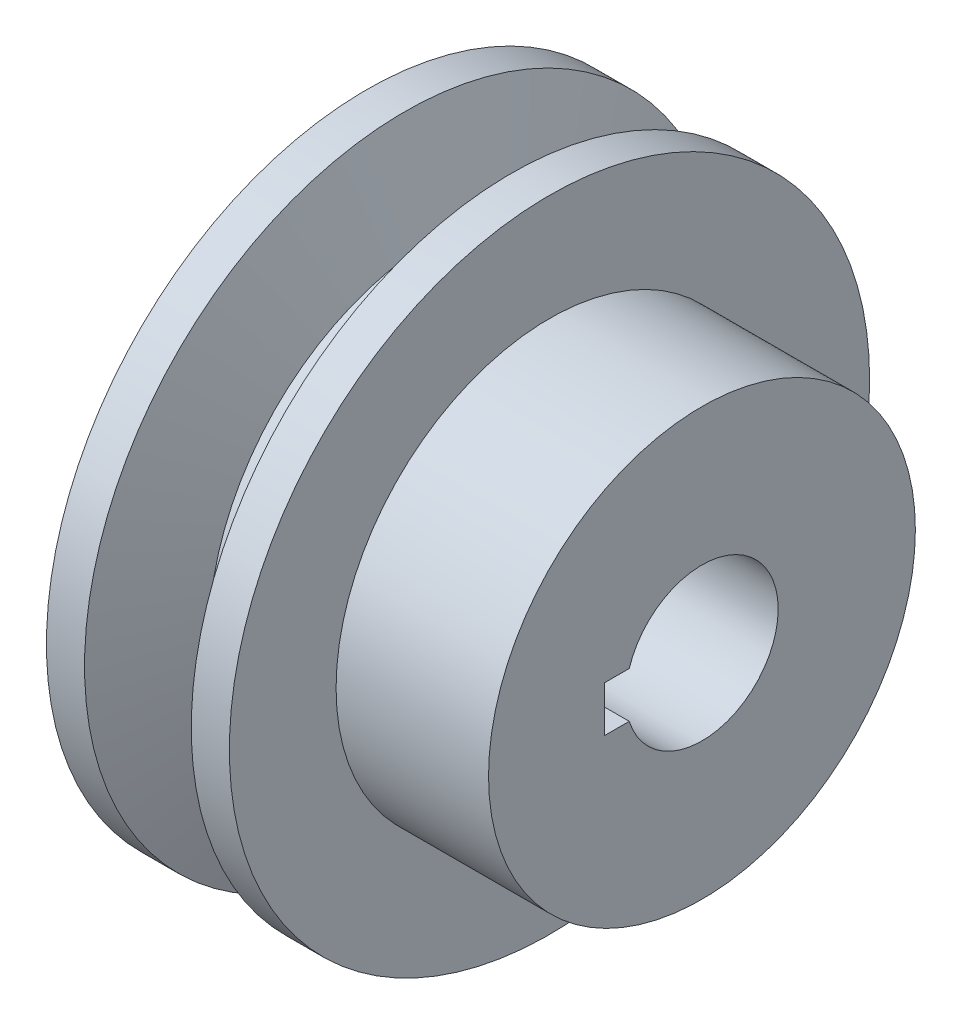
ISO-10303-21;
HEADER;
FILE_DESCRIPTION(('STEP AP214'),'2;1');
FILE_NAME('part.step','',(''),(''),'','','');
FILE_SCHEMA(('AUTOMOTIVE_DESIGN { 1 0 10303 214 1 1 1 1 }'));
ENDSEC;
DATA;
#1=APPLICATION_CONTEXT('core data for automotive mechanical design processes');
#2=APPLICATION_PROTOCOL_DEFINITION('international standard','automotive_design',2000,#1);
#3=PRODUCT_CONTEXT('',#1,'mechanical');
#4=PRODUCT('Part','Part','',(#3));
#5=PRODUCT_RELATED_PRODUCT_CATEGORY('part','',(#4));
#6=PRODUCT_DEFINITION_FORMATION('','',#4);
#7=PRODUCT_DEFINITION_CONTEXT('part definition',#1,'design');
#8=PRODUCT_DEFINITION('design','',#6,#7);
#9=PRODUCT_DEFINITION_SHAPE('','',#8);
#10=(LENGTH_UNIT() NAMED_UNIT(*) SI_UNIT(.MILLI.,.METRE.));
#11=(NAMED_UNIT(*) PLANE_ANGLE_UNIT() SI_UNIT($,.RADIAN.));
#12=(NAMED_UNIT(*) SI_UNIT($,.STERADIAN.) SOLID_ANGLE_UNIT());
#13=UNCERTAINTY_MEASURE_WITH_UNIT(LENGTH_MEASURE(1.E-05),#10,'distance_accuracy_value','');
#14=(GEOMETRIC_REPRESENTATION_CONTEXT(3) GLOBAL_UNCERTAINTY_ASSIGNED_CONTEXT((#13)) GLOBAL_UNIT_ASSIGNED_CONTEXT((#10,
#11,#12)) REPRESENTATION_CONTEXT('',''));
#15=CARTESIAN_POINT('',(0.,0.,0.));
#16=DIRECTION('',(0.,0.,1.));
#17=DIRECTION('',(1.,0.,0.));
#18=AXIS2_PLACEMENT_3D('',#15,#16,#17);
#19=CARTESIAN_POINT('',(22.,14.,0.));
#20=DIRECTION('',(1.,0.,0.));
#21=DIRECTION('',(0.,0.,-1.));
#22=AXIS2_PLACEMENT_3D('',#19,#20,#21);
#23=PLANE('',#22);
#24=DIRECTION('',(0.,0.,-1.));
#25=VECTOR('',#24,1.);
#26=CARTESIAN_POINT('',(22.,1.5,6.4));
#27=LINE('',#26,#25);
#28=CARTESIAN_POINT('',(22.,1.5,6.4));
#29=VERTEX_POINT('',#28);
#30=CARTESIAN_POINT('',(22.,1.5,4.76969600708473));
#31=VERTEX_POINT('',#30);
#32=EDGE_CURVE('E76',#29,#31,#27,.T.);
#33=ORIENTED_EDGE('',*,*,#32,.T.);
#34=CARTESIAN_POINT('',(22.,0.,0.));
#35=DIRECTION('',(-1.,0.,0.));
#36=DIRECTION('',(0.,0.,1.));
#37=AXIS2_PLACEMENT_3D('',#34,#35,#36);
#38=CIRCLE('',#37,5.);
#39=CARTESIAN_POINT('',(22.,-1.5,4.76969600708473));
#40=VERTEX_POINT('',#39);
#41=EDGE_CURVE('E85',#31,#40,#38,.T.);
#42=ORIENTED_EDGE('',*,*,#41,.T.);
#43=DIRECTION('',(0.,0.,1.));
#44=VECTOR('',#43,1.);
#45=CARTESIAN_POINT('',(22.,-1.5,6.4));
#46=LINE('',#45,#44);
#47=CARTESIAN_POINT('',(22.,-1.5,6.4));
#48=VERTEX_POINT('',#47);
#49=EDGE_CURVE('E48',#40,#48,#46,.T.);
#50=ORIENTED_EDGE('',*,*,#49,.T.);
#51=DIRECTION('',(0.,1.,0.));
#52=VECTOR('',#51,1.);
#53=CARTESIAN_POINT('',(22.,1.5,6.4));
#54=LINE('',#53,#52);
#55=EDGE_CURVE('E82',#48,#29,#54,.T.);
#56=ORIENTED_EDGE('',*,*,#55,.T.);
#57=EDGE_LOOP('',(#33,#42,#50,#56));
#58=FACE_BOUND('',#57,.T.);
#59=CARTESIAN_POINT('',(22.,0.,0.));
#60=DIRECTION('',(1.,0.,0.));
#61=DIRECTION('',(0.,0.,-1.));
#62=AXIS2_PLACEMENT_3D('',#59,#60,#61);
#63=CIRCLE('',#62,14.);
#64=CARTESIAN_POINT('',(22.,0.,-14.));
#65=VERTEX_POINT('',#64);
#66=EDGE_CURVE('E106',#65,#65,#63,.T.);
#67=ORIENTED_EDGE('',*,*,#66,.T.);
#68=EDGE_LOOP('',(#67));
#69=FACE_BOUND('',#68,.T.);
#70=ADVANCED_FACE('F34',(#58,#69),#23,.T.);
#71=CARTESIAN_POINT('',(0.,0.,0.));
#72=DIRECTION('',(-1.,0.,0.));
#73=DIRECTION('',(0.,0.,1.));
#74=AXIS2_PLACEMENT_3D('',#71,#72,#73);
#75=PLANE('',#74);
#76=DIRECTION('',(0.,0.,-1.));
#77=VECTOR('',#76,1.);
#78=CARTESIAN_POINT('',(0.,1.5,6.4));
#79=LINE('',#78,#77);
#80=CARTESIAN_POINT('',(0.,1.5,6.4));
#81=VERTEX_POINT('',#80);
#82=CARTESIAN_POINT('',(0.,1.5,4.76969600708473));
#83=VERTEX_POINT('',#82);
#84=EDGE_CURVE('E56',#81,#83,#79,.T.);
#85=ORIENTED_EDGE('',*,*,#84,.F.);
#86=DIRECTION('',(0.,1.,0.));
#87=VECTOR('',#86,1.);
#88=CARTESIAN_POINT('',(0.,1.5,6.4));
#89=LINE('',#88,#87);
#90=CARTESIAN_POINT('',(0.,-1.5,6.4));
#91=VERTEX_POINT('',#90);
#92=EDGE_CURVE('E91',#91,#81,#89,.T.);
#93=ORIENTED_EDGE('',*,*,#92,.F.);
#94=DIRECTION('',(0.,0.,1.));
#95=VECTOR('',#94,1.);
#96=CARTESIAN_POINT('',(0.,-1.5,6.4));
#97=LINE('',#96,#95);
#98=CARTESIAN_POINT('',(0.,-1.5,4.76969600708473));
#99=VERTEX_POINT('',#98);
#100=EDGE_CURVE('E94',#99,#91,#97,.T.);
#101=ORIENTED_EDGE('',*,*,#100,.F.);
#102=CARTESIAN_POINT('',(0.,0.,0.));
#103=DIRECTION('',(-1.,0.,0.));
#104=DIRECTION('',(0.,0.,1.));
#105=AXIS2_PLACEMENT_3D('',#102,#103,#104);
#106=CIRCLE('',#105,5.);
#107=EDGE_CURVE('E100',#83,#99,#106,.T.);
#108=ORIENTED_EDGE('',*,*,#107,.F.);
#109=EDGE_LOOP('',(#85,#93,#101,#108));
#110=FACE_BOUND('',#109,.T.);
#111=CARTESIAN_POINT('',(0.,0.,0.));
#112=DIRECTION('',(1.,0.,0.));
#113=DIRECTION('',(0.,0.,-1.));
#114=AXIS2_PLACEMENT_3D('',#111,#112,#113);
#115=CIRCLE('',#114,21.);
#116=CARTESIAN_POINT('',(0.,0.,-21.));
#117=VERTEX_POINT('',#116);
#118=EDGE_CURVE('E11',#117,#117,#115,.T.);
#119=ORIENTED_EDGE('',*,*,#118,.F.);
#120=EDGE_LOOP('',(#119));
#121=FACE_BOUND('',#120,.T.);
#122=ADVANCED_FACE('F134',(#110,#121),#75,.T.);
#123=CARTESIAN_POINT('',(22.,0.,0.));
#124=DIRECTION('',(1.,0.,0.));
#125=DIRECTION('',(0.,0.,-1.));
#126=AXIS2_PLACEMENT_3D('',#123,#124,#125);
#127=CYLINDRICAL_SURFACE('',#126,21.);
#128=ORIENTED_EDGE('',*,*,#118,.T.);
#129=EDGE_LOOP('',(#128));
#130=FACE_BOUND('',#129,.T.);
#131=CARTESIAN_POINT('',(2.5,0.,0.));
#132=DIRECTION('',(1.,0.,0.));
#133=DIRECTION('',(0.,0.,-1.));
#134=AXIS2_PLACEMENT_3D('',#131,#132,#133);
#135=CIRCLE('',#134,21.);
#136=CARTESIAN_POINT('',(2.5,0.,-21.));
#137=VERTEX_POINT('',#136);
#138=EDGE_CURVE('E41',#137,#137,#135,.T.);
#139=ORIENTED_EDGE('',*,*,#138,.F.);
#140=EDGE_LOOP('',(#139));
#141=FACE_BOUND('',#140,.T.);
#142=ADVANCED_FACE('F132',(#130,#141),#127,.T.);
#143=CARTESIAN_POINT('',(4.6838214055972,0.,0.));
#144=DIRECTION('',(-1.,0.,0.));
#145=DIRECTION('',(0.,0.,1.));
#146=AXIS2_PLACEMENT_3D('',#143,#144,#145);
#147=CONICAL_SURFACE('',#146,15.,1.22173047639603);
#148=ORIENTED_EDGE('',*,*,#138,.T.);
#149=EDGE_LOOP('',(#148));
#150=FACE_BOUND('',#149,.T.);
#151=CARTESIAN_POINT('',(4.6838214055972,0.,0.));
#152=DIRECTION('',(1.,0.,0.));
#153=DIRECTION('',(0.,0.,-1.));
#154=AXIS2_PLACEMENT_3D('',#151,#152,#153);
#155=CIRCLE('',#154,15.);
#156=CARTESIAN_POINT('',(4.6838214055972,0.,-15.));
#157=VERTEX_POINT('',#156);
#158=EDGE_CURVE('E124',#157,#157,#155,.T.);
#159=ORIENTED_EDGE('',*,*,#158,.F.);
#160=EDGE_LOOP('',(#159));
#161=FACE_BOUND('',#160,.T.);
#162=ADVANCED_FACE('F129',(#150,#161),#147,.T.);
#163=CARTESIAN_POINT('',(22.,0.,0.));
#164=DIRECTION('',(1.,0.,0.));
#165=DIRECTION('',(0.,0.,-1.));
#166=AXIS2_PLACEMENT_3D('',#163,#164,#165);
#167=CYLINDRICAL_SURFACE('',#166,15.);
#168=ORIENTED_EDGE('',*,*,#158,.T.);
#169=EDGE_LOOP('',(#168));
#170=FACE_BOUND('',#169,.T.);
#171=CARTESIAN_POINT('',(7.3161785944028,0.,0.));
#172=DIRECTION('',(1.,0.,0.));
#173=DIRECTION('',(0.,0.,-1.));
#174=AXIS2_PLACEMENT_3D('',#171,#172,#173);
#175=CIRCLE('',#174,15.);
#176=CARTESIAN_POINT('',(7.3161785944028,0.,-15.));
#177=VERTEX_POINT('',#176);
#178=EDGE_CURVE('E121',#177,#177,#175,.T.);
#179=ORIENTED_EDGE('',*,*,#178,.F.);
#180=EDGE_LOOP('',(#179));
#181=FACE_BOUND('',#180,.T.);
#182=ADVANCED_FACE('F141',(#170,#181),#167,.T.);
#183=CARTESIAN_POINT('',(9.5,0.,0.));
#184=DIRECTION('',(1.,0.,0.));
#185=DIRECTION('',(0.,0.,-1.));
#186=AXIS2_PLACEMENT_3D('',#183,#184,#185);
#187=CONICAL_SURFACE('',#186,21.,1.22173047639603);
#188=ORIENTED_EDGE('',*,*,#178,.T.);
#189=EDGE_LOOP('',(#188));
#190=FACE_BOUND('',#189,.T.);
#191=CARTESIAN_POINT('',(9.5,0.,0.));
#192=DIRECTION('',(1.,0.,0.));
#193=DIRECTION('',(0.,0.,-1.));
#194=AXIS2_PLACEMENT_3D('',#191,#192,#193);
#195=CIRCLE('',#194,21.);
#196=CARTESIAN_POINT('',(9.5,0.,-21.));
#197=VERTEX_POINT('',#196);
#198=EDGE_CURVE('E118',#197,#197,#195,.T.);
#199=ORIENTED_EDGE('',*,*,#198,.F.);
#200=EDGE_LOOP('',(#199));
#201=FACE_BOUND('',#200,.T.);
#202=ADVANCED_FACE('F205',(#190,#201),#187,.T.);
#203=CARTESIAN_POINT('',(22.,0.,0.));
#204=DIRECTION('',(1.,0.,0.));
#205=DIRECTION('',(0.,0.,-1.));
#206=AXIS2_PLACEMENT_3D('',#203,#204,#205);
#207=CYLINDRICAL_SURFACE('',#206,21.);
#208=ORIENTED_EDGE('',*,*,#198,.T.);
#209=EDGE_LOOP('',(#208));
#210=FACE_BOUND('',#209,.T.);
#211=CARTESIAN_POINT('',(12.,0.,0.));
#212=DIRECTION('',(1.,0.,0.));
#213=DIRECTION('',(0.,0.,-1.));
#214=AXIS2_PLACEMENT_3D('',#211,#212,#213);
#215=CIRCLE('',#214,21.);
#216=CARTESIAN_POINT('',(12.,0.,-21.));
#217=VERTEX_POINT('',#216);
#218=EDGE_CURVE('E115',#217,#217,#215,.T.);
#219=ORIENTED_EDGE('',*,*,#218,.F.);
#220=EDGE_LOOP('',(#219));
#221=FACE_BOUND('',#220,.T.);
#222=ADVANCED_FACE('F201',(#210,#221),#207,.T.);
#223=CARTESIAN_POINT('',(12.,21.,0.));
#224=DIRECTION('',(1.,0.,0.));
#225=DIRECTION('',(0.,0.,-1.));
#226=AXIS2_PLACEMENT_3D('',#223,#224,#225);
#227=PLANE('',#226);
#228=ORIENTED_EDGE('',*,*,#218,.T.);
#229=EDGE_LOOP('',(#228));
#230=FACE_BOUND('',#229,.T.);
#231=CARTESIAN_POINT('',(12.,0.,0.));
#232=DIRECTION('',(1.,0.,0.));
#233=DIRECTION('',(0.,0.,-1.));
#234=AXIS2_PLACEMENT_3D('',#231,#232,#233);
#235=CIRCLE('',#234,14.);
#236=CARTESIAN_POINT('',(12.,0.,-14.));
#237=VERTEX_POINT('',#236);
#238=EDGE_CURVE('E112',#237,#237,#235,.T.);
#239=ORIENTED_EDGE('',*,*,#238,.F.);
#240=EDGE_LOOP('',(#239));
#241=FACE_BOUND('',#240,.T.);
#242=ADVANCED_FACE('F197',(#230,#241),#227,.T.);
#243=CARTESIAN_POINT('',(22.,0.,0.));
#244=DIRECTION('',(1.,0.,0.));
#245=DIRECTION('',(0.,0.,-1.));
#246=AXIS2_PLACEMENT_3D('',#243,#244,#245);
#247=CYLINDRICAL_SURFACE('',#246,14.);
#248=ORIENTED_EDGE('',*,*,#238,.T.);
#249=EDGE_LOOP('',(#248));
#250=FACE_BOUND('',#249,.T.);
#251=ORIENTED_EDGE('',*,*,#66,.F.);
#252=EDGE_LOOP('',(#251));
#253=FACE_BOUND('',#252,.T.);
#254=ADVANCED_FACE('F163',(#250,#253),#247,.T.);
#255=CARTESIAN_POINT('',(22.,1.5,6.4));
#256=DIRECTION('',(0.,1.,0.));
#257=DIRECTION('',(0.,0.,1.));
#258=AXIS2_PLACEMENT_3D('',#255,#256,#257);
#259=PLANE('',#258);
#260=ORIENTED_EDGE('',*,*,#84,.T.);
#261=DIRECTION('',(-1.,0.,0.));
#262=VECTOR('',#261,1.);
#263=CARTESIAN_POINT('',(22.,1.5,4.76969600708473));
#264=LINE('',#263,#262);
#265=EDGE_CURVE('E72',#31,#83,#264,.T.);
#266=ORIENTED_EDGE('',*,*,#265,.F.);
#267=ORIENTED_EDGE('',*,*,#32,.F.);
#268=DIRECTION('',(-1.,0.,0.));
#269=VECTOR('',#268,1.);
#270=CARTESIAN_POINT('',(22.,1.5,6.4));
#271=LINE('',#270,#269);
#272=EDGE_CURVE('E104',#29,#81,#271,.T.);
#273=ORIENTED_EDGE('',*,*,#272,.T.);
#274=EDGE_LOOP('',(#260,#266,#267,#273));
#275=FACE_BOUND('',#274,.T.);
#276=ADVANCED_FACE('F74',(#275),#259,.F.);
#277=CARTESIAN_POINT('',(22.,1.5,6.4));
#278=DIRECTION('',(0.,0.,1.));
#279=DIRECTION('',(0.,-1.,0.));
#280=AXIS2_PLACEMENT_3D('',#277,#278,#279);
#281=PLANE('',#280);
#282=ORIENTED_EDGE('',*,*,#92,.T.);
#283=ORIENTED_EDGE('',*,*,#272,.F.);
#284=ORIENTED_EDGE('',*,*,#55,.F.);
#285=DIRECTION('',(-1.,0.,0.));
#286=VECTOR('',#285,1.);
#287=CARTESIAN_POINT('',(22.,-1.5,6.4));
#288=LINE('',#287,#286);
#289=EDGE_CURVE('E107',#48,#91,#288,.T.);
#290=ORIENTED_EDGE('',*,*,#289,.T.);
#291=EDGE_LOOP('',(#282,#283,#284,#290));
#292=FACE_BOUND('',#291,.T.);
#293=ADVANCED_FACE('F162',(#292),#281,.F.);
#294=CARTESIAN_POINT('',(22.,-1.5,6.4));
#295=DIRECTION('',(0.,-1.,0.));
#296=DIRECTION('',(0.,0.,-1.));
#297=AXIS2_PLACEMENT_3D('',#294,#295,#296);
#298=PLANE('',#297);
#299=ORIENTED_EDGE('',*,*,#100,.T.);
#300=ORIENTED_EDGE('',*,*,#289,.F.);
#301=ORIENTED_EDGE('',*,*,#49,.F.);
#302=DIRECTION('',(-1.,0.,0.));
#303=VECTOR('',#302,1.);
#304=CARTESIAN_POINT('',(22.,-1.5,4.76969600708473));
#305=LINE('',#304,#303);
#306=EDGE_CURVE('E81',#40,#99,#305,.T.);
#307=ORIENTED_EDGE('',*,*,#306,.T.);
#308=EDGE_LOOP('',(#299,#300,#301,#307));
#309=FACE_BOUND('',#308,.T.);
#310=ADVANCED_FACE('F174',(#309),#298,.F.);
#311=CARTESIAN_POINT('',(22.,0.,0.));
#312=DIRECTION('',(-1.,0.,0.));
#313=DIRECTION('',(0.,0.,1.));
#314=AXIS2_PLACEMENT_3D('',#311,#312,#313);
#315=CYLINDRICAL_SURFACE('',#314,5.);
#316=ORIENTED_EDGE('',*,*,#107,.T.);
#317=ORIENTED_EDGE('',*,*,#306,.F.);
#318=ORIENTED_EDGE('',*,*,#41,.F.);
#319=ORIENTED_EDGE('',*,*,#265,.T.);
#320=EDGE_LOOP('',(#316,#317,#318,#319));
#321=FACE_BOUND('',#320,.T.);
#322=ADVANCED_FACE('F86',(#321),#315,.F.);
#323=CLOSED_SHELL('',(#70,#122,#142,#162,#182,#202,#222,#242,#254,#276,#293,#310,#322));
#324=MANIFOLD_SOLID_BREP('B2',#323);
#325=ADVANCED_BREP_SHAPE_REPRESENTATION('',(#18,#324),#14);
#326=SHAPE_DEFINITION_REPRESENTATION(#9,#325);
ENDSEC;
END-ISO-10303-21;
